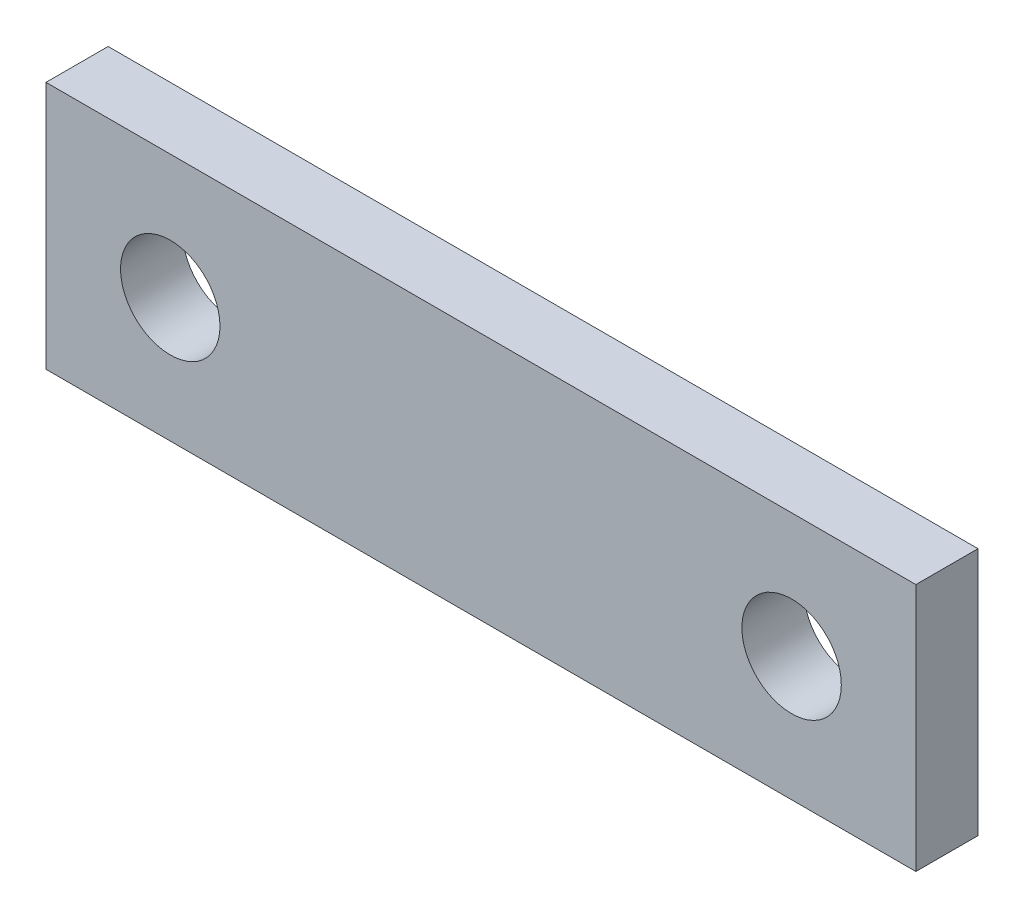
ISO-10303-21;
HEADER;
FILE_DESCRIPTION(('STEP AP214'),'2;1');
FILE_NAME('part.step','',(''),(''),'','','');
FILE_SCHEMA(('AUTOMOTIVE_DESIGN { 1 0 10303 214 1 1 1 1 }'));
ENDSEC;
DATA;
#1=APPLICATION_CONTEXT('core data for automotive mechanical design processes');
#2=APPLICATION_PROTOCOL_DEFINITION('international standard','automotive_design',2000,#1);
#3=PRODUCT_CONTEXT('',#1,'mechanical');
#4=PRODUCT('Part','Part','',(#3));
#5=PRODUCT_RELATED_PRODUCT_CATEGORY('part','',(#4));
#6=PRODUCT_DEFINITION_FORMATION('','',#4);
#7=PRODUCT_DEFINITION_CONTEXT('part definition',#1,'design');
#8=PRODUCT_DEFINITION('design','',#6,#7);
#9=PRODUCT_DEFINITION_SHAPE('','',#8);
#10=(LENGTH_UNIT() NAMED_UNIT(*) SI_UNIT(.MILLI.,.METRE.));
#11=(NAMED_UNIT(*) PLANE_ANGLE_UNIT() SI_UNIT($,.RADIAN.));
#12=(NAMED_UNIT(*) SI_UNIT($,.STERADIAN.) SOLID_ANGLE_UNIT());
#13=UNCERTAINTY_MEASURE_WITH_UNIT(LENGTH_MEASURE(1.E-05),#10,'distance_accuracy_value','');
#14=(GEOMETRIC_REPRESENTATION_CONTEXT(3) GLOBAL_UNCERTAINTY_ASSIGNED_CONTEXT((#13)) GLOBAL_UNIT_ASSIGNED_CONTEXT((#10,
#11,#12)) REPRESENTATION_CONTEXT('',''));
#15=CARTESIAN_POINT('',(0.,0.,0.));
#16=DIRECTION('',(0.,0.,1.));
#17=DIRECTION('',(1.,0.,0.));
#18=AXIS2_PLACEMENT_3D('',#15,#16,#17);
#19=CARTESIAN_POINT('',(0.,0.,5.));
#20=DIRECTION('',(0.,0.,-1.));
#21=DIRECTION('',(-1.,0.,0.));
#22=AXIS2_PLACEMENT_3D('',#19,#20,#21);
#23=PLANE('',#22);
#24=DIRECTION('',(1.,0.,0.));
#25=VECTOR('',#24,1.);
#26=CARTESIAN_POINT('',(-10.,-10.,5.));
#27=LINE('',#26,#25);
#28=CARTESIAN_POINT('',(-10.,-10.,5.));
#29=VERTEX_POINT('',#28);
#30=CARTESIAN_POINT('',(60.,-10.,5.));
#31=VERTEX_POINT('',#30);
#32=EDGE_CURVE('E81',#29,#31,#27,.T.);
#33=ORIENTED_EDGE('',*,*,#32,.T.);
#34=DIRECTION('',(0.,1.,0.));
#35=VECTOR('',#34,1.);
#36=CARTESIAN_POINT('',(60.,10.,5.));
#37=LINE('',#36,#35);
#38=CARTESIAN_POINT('',(60.,10.,5.));
#39=VERTEX_POINT('',#38);
#40=EDGE_CURVE('E84',#31,#39,#37,.T.);
#41=ORIENTED_EDGE('',*,*,#40,.T.);
#42=DIRECTION('',(-1.,0.,0.));
#43=VECTOR('',#42,1.);
#44=CARTESIAN_POINT('',(40.,10.,5.));
#45=LINE('',#44,#43);
#46=CARTESIAN_POINT('',(-10.,10.,5.));
#47=VERTEX_POINT('',#46);
#48=EDGE_CURVE('E88',#39,#47,#45,.T.);
#49=ORIENTED_EDGE('',*,*,#48,.T.);
#50=DIRECTION('',(0.,-1.,0.));
#51=VECTOR('',#50,1.);
#52=CARTESIAN_POINT('',(-10.,10.,5.));
#53=LINE('',#52,#51);
#54=EDGE_CURVE('E53',#47,#29,#53,.T.);
#55=ORIENTED_EDGE('',*,*,#54,.T.);
#56=EDGE_LOOP('',(#33,#41,#49,#55));
#57=FACE_BOUND('',#56,.T.);
#58=CARTESIAN_POINT('',(0.,0.,5.));
#59=DIRECTION('',(0.,0.,1.));
#60=DIRECTION('',(1.,0.,0.));
#61=AXIS2_PLACEMENT_3D('',#58,#59,#60);
#62=CIRCLE('',#61,4.);
#63=CARTESIAN_POINT('',(4.,0.,5.));
#64=VERTEX_POINT('',#63);
#65=EDGE_CURVE('E102',#64,#64,#62,.T.);
#66=ORIENTED_EDGE('',*,*,#65,.F.);
#67=EDGE_LOOP('',(#66));
#68=FACE_BOUND('',#67,.T.);
#69=CARTESIAN_POINT('',(50.,0.,5.));
#70=DIRECTION('',(0.,0.,1.));
#71=DIRECTION('',(1.,0.,0.));
#72=AXIS2_PLACEMENT_3D('',#69,#70,#71);
#73=CIRCLE('',#72,4.);
#74=CARTESIAN_POINT('',(54.,0.,5.));
#75=VERTEX_POINT('',#74);
#76=EDGE_CURVE('E120',#75,#75,#73,.T.);
#77=ORIENTED_EDGE('',*,*,#76,.F.);
#78=EDGE_LOOP('',(#77));
#79=FACE_BOUND('',#78,.T.);
#80=ADVANCED_FACE('F36',(#57,#68,#79),#23,.F.);
#81=CARTESIAN_POINT('',(0.,0.,0.));
#82=DIRECTION('',(0.,0.,-1.));
#83=DIRECTION('',(-1.,0.,0.));
#84=AXIS2_PLACEMENT_3D('',#81,#82,#83);
#85=PLANE('',#84);
#86=CARTESIAN_POINT('',(0.,0.,0.));
#87=DIRECTION('',(0.,0.,1.));
#88=DIRECTION('',(1.,0.,0.));
#89=AXIS2_PLACEMENT_3D('',#86,#87,#88);
#90=CIRCLE('',#89,4.);
#91=CARTESIAN_POINT('',(4.,0.,0.));
#92=VERTEX_POINT('',#91);
#93=EDGE_CURVE('E123',#92,#92,#90,.T.);
#94=ORIENTED_EDGE('',*,*,#93,.T.);
#95=EDGE_LOOP('',(#94));
#96=FACE_BOUND('',#95,.T.);
#97=DIRECTION('',(1.,0.,0.));
#98=VECTOR('',#97,1.);
#99=CARTESIAN_POINT('',(40.,-10.,0.));
#100=LINE('',#99,#98);
#101=CARTESIAN_POINT('',(-10.,-10.,0.));
#102=VERTEX_POINT('',#101);
#103=CARTESIAN_POINT('',(60.,-10.,0.));
#104=VERTEX_POINT('',#103);
#105=EDGE_CURVE('E76',#102,#104,#100,.T.);
#106=ORIENTED_EDGE('',*,*,#105,.F.);
#107=DIRECTION('',(0.,-1.,0.));
#108=VECTOR('',#107,1.);
#109=CARTESIAN_POINT('',(-10.,10.,0.));
#110=LINE('',#109,#108);
#111=CARTESIAN_POINT('',(-10.,10.,0.));
#112=VERTEX_POINT('',#111);
#113=EDGE_CURVE('E105',#112,#102,#110,.T.);
#114=ORIENTED_EDGE('',*,*,#113,.F.);
#115=DIRECTION('',(-1.,0.,0.));
#116=VECTOR('',#115,1.);
#117=CARTESIAN_POINT('',(-10.,10.,0.));
#118=LINE('',#117,#116);
#119=CARTESIAN_POINT('',(60.,10.,0.));
#120=VERTEX_POINT('',#119);
#121=EDGE_CURVE('E69',#120,#112,#118,.T.);
#122=ORIENTED_EDGE('',*,*,#121,.F.);
#123=DIRECTION('',(0.,1.,0.));
#124=VECTOR('',#123,1.);
#125=CARTESIAN_POINT('',(60.,10.,0.));
#126=LINE('',#125,#124);
#127=EDGE_CURVE('E93',#104,#120,#126,.T.);
#128=ORIENTED_EDGE('',*,*,#127,.F.);
#129=EDGE_LOOP('',(#106,#114,#122,#128));
#130=FACE_BOUND('',#129,.T.);
#131=CARTESIAN_POINT('',(50.,0.,0.));
#132=DIRECTION('',(0.,0.,1.));
#133=DIRECTION('',(1.,0.,0.));
#134=AXIS2_PLACEMENT_3D('',#131,#132,#133);
#135=CIRCLE('',#134,4.);
#136=CARTESIAN_POINT('',(54.,0.,0.));
#137=VERTEX_POINT('',#136);
#138=EDGE_CURVE('E118',#137,#137,#135,.T.);
#139=ORIENTED_EDGE('',*,*,#138,.T.);
#140=EDGE_LOOP('',(#139));
#141=FACE_BOUND('',#140,.T.);
#142=ADVANCED_FACE('F111',(#96,#130,#141),#85,.T.);
#143=CARTESIAN_POINT('',(40.,-10.,5.));
#144=DIRECTION('',(0.,1.,0.));
#145=DIRECTION('',(0.,0.,1.));
#146=AXIS2_PLACEMENT_3D('',#143,#144,#145);
#147=PLANE('',#146);
#148=ORIENTED_EDGE('',*,*,#105,.T.);
#149=DIRECTION('',(0.,0.,-1.));
#150=VECTOR('',#149,1.);
#151=CARTESIAN_POINT('',(60.,-10.,5.));
#152=LINE('',#151,#150);
#153=EDGE_CURVE('E11',#31,#104,#152,.T.);
#154=ORIENTED_EDGE('',*,*,#153,.F.);
#155=ORIENTED_EDGE('',*,*,#32,.F.);
#156=DIRECTION('',(0.,0.,-1.));
#157=VECTOR('',#156,1.);
#158=CARTESIAN_POINT('',(-10.,-10.,5.));
#159=LINE('',#158,#157);
#160=EDGE_CURVE('E97',#29,#102,#159,.T.);
#161=ORIENTED_EDGE('',*,*,#160,.T.);
#162=EDGE_LOOP('',(#148,#154,#155,#161));
#163=FACE_BOUND('',#162,.T.);
#164=ADVANCED_FACE('F38',(#163),#147,.F.);
#165=CARTESIAN_POINT('',(60.,10.,5.));
#166=DIRECTION('',(-1.,0.,0.));
#167=DIRECTION('',(0.,0.,1.));
#168=AXIS2_PLACEMENT_3D('',#165,#166,#167);
#169=PLANE('',#168);
#170=ORIENTED_EDGE('',*,*,#127,.T.);
#171=DIRECTION('',(0.,0.,-1.));
#172=VECTOR('',#171,1.);
#173=CARTESIAN_POINT('',(60.,10.,5.));
#174=LINE('',#173,#172);
#175=EDGE_CURVE('E45',#39,#120,#174,.T.);
#176=ORIENTED_EDGE('',*,*,#175,.F.);
#177=ORIENTED_EDGE('',*,*,#40,.F.);
#178=ORIENTED_EDGE('',*,*,#153,.T.);
#179=EDGE_LOOP('',(#170,#176,#177,#178));
#180=FACE_BOUND('',#179,.T.);
#181=ADVANCED_FACE('F92',(#180),#169,.F.);
#182=CARTESIAN_POINT('',(-10.,10.,5.));
#183=DIRECTION('',(0.,-1.,0.));
#184=DIRECTION('',(1.,0.,0.));
#185=AXIS2_PLACEMENT_3D('',#182,#183,#184);
#186=PLANE('',#185);
#187=ORIENTED_EDGE('',*,*,#121,.T.);
#188=DIRECTION('',(0.,0.,-1.));
#189=VECTOR('',#188,1.);
#190=CARTESIAN_POINT('',(-10.,10.,5.));
#191=LINE('',#190,#189);
#192=EDGE_CURVE('E94',#47,#112,#191,.T.);
#193=ORIENTED_EDGE('',*,*,#192,.F.);
#194=ORIENTED_EDGE('',*,*,#48,.F.);
#195=ORIENTED_EDGE('',*,*,#175,.T.);
#196=EDGE_LOOP('',(#187,#193,#194,#195));
#197=FACE_BOUND('',#196,.T.);
#198=ADVANCED_FACE('F95',(#197),#186,.F.);
#199=CARTESIAN_POINT('',(-10.,10.,5.));
#200=DIRECTION('',(1.,0.,0.));
#201=DIRECTION('',(0.,1.,0.));
#202=AXIS2_PLACEMENT_3D('',#199,#200,#201);
#203=PLANE('',#202);
#204=ORIENTED_EDGE('',*,*,#113,.T.);
#205=ORIENTED_EDGE('',*,*,#160,.F.);
#206=ORIENTED_EDGE('',*,*,#54,.F.);
#207=ORIENTED_EDGE('',*,*,#192,.T.);
#208=EDGE_LOOP('',(#204,#205,#206,#207));
#209=FACE_BOUND('',#208,.T.);
#210=ADVANCED_FACE('F110',(#209),#203,.F.);
#211=CARTESIAN_POINT('',(0.,0.,5.));
#212=DIRECTION('',(0.,0.,-1.));
#213=DIRECTION('',(-1.,0.,0.));
#214=AXIS2_PLACEMENT_3D('',#211,#212,#213);
#215=CYLINDRICAL_SURFACE('',#214,4.);
#216=ORIENTED_EDGE('',*,*,#65,.T.);
#217=EDGE_LOOP('',(#216));
#218=FACE_BOUND('',#217,.T.);
#219=ORIENTED_EDGE('',*,*,#93,.F.);
#220=EDGE_LOOP('',(#219));
#221=FACE_BOUND('',#220,.T.);
#222=ADVANCED_FACE('F131',(#218,#221),#215,.F.);
#223=CARTESIAN_POINT('',(50.,0.,5.));
#224=DIRECTION('',(0.,0.,-1.));
#225=DIRECTION('',(-1.,0.,0.));
#226=AXIS2_PLACEMENT_3D('',#223,#224,#225);
#227=CYLINDRICAL_SURFACE('',#226,4.);
#228=ORIENTED_EDGE('',*,*,#76,.T.);
#229=EDGE_LOOP('',(#228));
#230=FACE_BOUND('',#229,.T.);
#231=ORIENTED_EDGE('',*,*,#138,.F.);
#232=EDGE_LOOP('',(#231));
#233=FACE_BOUND('',#232,.T.);
#234=ADVANCED_FACE('F133',(#230,#233),#227,.F.);
#235=CLOSED_SHELL('',(#80,#142,#164,#181,#198,#210,#222,#234));
#236=MANIFOLD_SOLID_BREP('B2',#235);
#237=ADVANCED_BREP_SHAPE_REPRESENTATION('',(#18,#236),#14);
#238=SHAPE_DEFINITION_REPRESENTATION(#9,#237);
ENDSEC;
END-ISO-10303-21;
